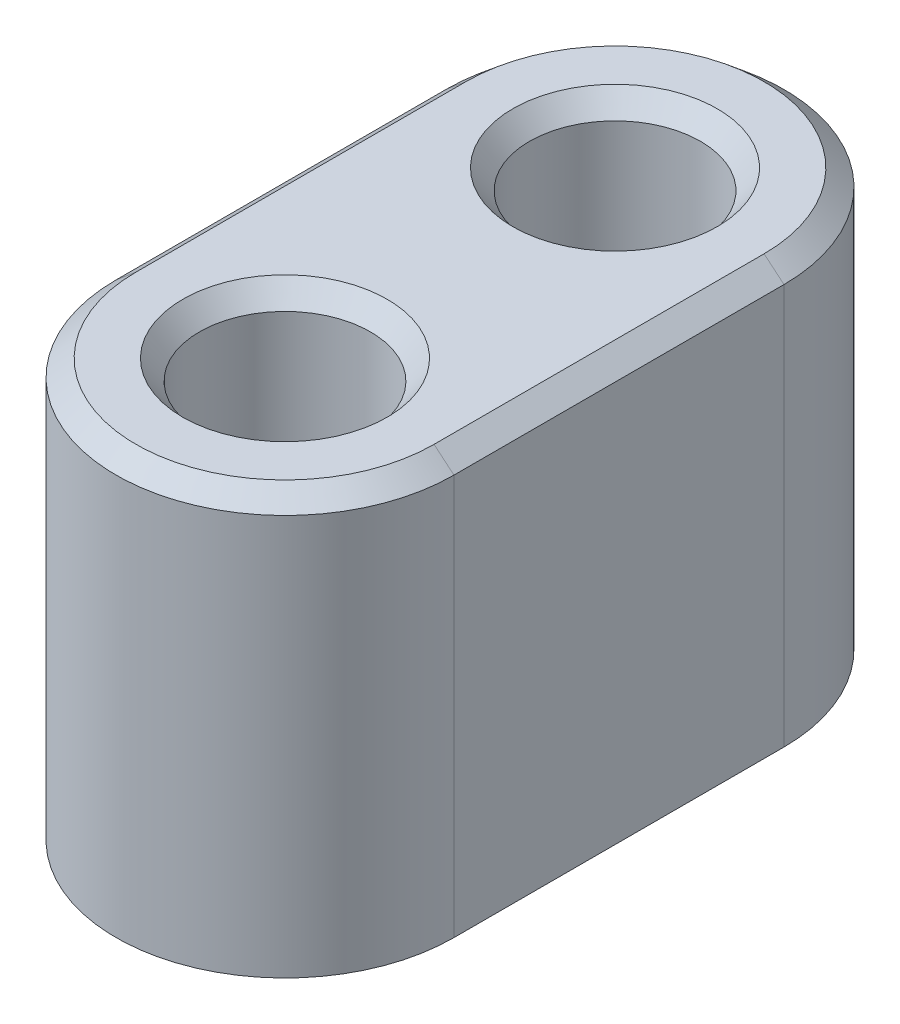
ISO-10303-21;
HEADER;
FILE_DESCRIPTION(('STEP AP214'),'2;1');
FILE_NAME('part.step','',(''),(''),'','','');
FILE_SCHEMA(('AUTOMOTIVE_DESIGN { 1 0 10303 214 1 1 1 1 }'));
ENDSEC;
DATA;
#1=APPLICATION_CONTEXT('core data for automotive mechanical design processes');
#2=APPLICATION_PROTOCOL_DEFINITION('international standard','automotive_design',2000,#1);
#3=PRODUCT_CONTEXT('',#1,'mechanical');
#4=PRODUCT('Part','Part','',(#3));
#5=PRODUCT_RELATED_PRODUCT_CATEGORY('part','',(#4));
#6=PRODUCT_DEFINITION_FORMATION('','',#4);
#7=PRODUCT_DEFINITION_CONTEXT('part definition',#1,'design');
#8=PRODUCT_DEFINITION('design','',#6,#7);
#9=PRODUCT_DEFINITION_SHAPE('','',#8);
#10=(LENGTH_UNIT() NAMED_UNIT(*) SI_UNIT(.MILLI.,.METRE.));
#11=(NAMED_UNIT(*) PLANE_ANGLE_UNIT() SI_UNIT($,.RADIAN.));
#12=(NAMED_UNIT(*) SI_UNIT($,.STERADIAN.) SOLID_ANGLE_UNIT());
#13=UNCERTAINTY_MEASURE_WITH_UNIT(LENGTH_MEASURE(1.E-05),#10,'distance_accuracy_value','');
#14=(GEOMETRIC_REPRESENTATION_CONTEXT(3) GLOBAL_UNCERTAINTY_ASSIGNED_CONTEXT((#13)) GLOBAL_UNIT_ASSIGNED_CONTEXT((#10,
#11,#12)) REPRESENTATION_CONTEXT('',''));
#15=CARTESIAN_POINT('',(0.,0.,0.));
#16=DIRECTION('',(0.,0.,1.));
#17=DIRECTION('',(1.,0.,0.));
#18=AXIS2_PLACEMENT_3D('',#15,#16,#17);
#19=CARTESIAN_POINT('',(0.,10.,3.955));
#20=DIRECTION('',(0.,1.,0.));
#21=DIRECTION('',(0.,0.,1.));
#22=AXIS2_PLACEMENT_3D('',#19,#20,#21);
#23=PLANE('',#22);
#24=CARTESIAN_POINT('',(0.,10.,3.955));
#25=DIRECTION('',(0.,1.,0.));
#26=DIRECTION('',(0.,0.,1.));
#27=AXIS2_PLACEMENT_3D('',#24,#25,#26);
#28=CIRCLE('',#27,3.57329856296232);
#29=CARTESIAN_POINT('',(-3.57329856296232,10.,3.955));
#30=VERTEX_POINT('',#29);
#31=CARTESIAN_POINT('',(3.57329856296232,10.,3.955));
#32=VERTEX_POINT('',#31);
#33=EDGE_CURVE('E179',#30,#32,#28,.T.);
#34=ORIENTED_EDGE('',*,*,#33,.T.);
#35=DIRECTION('',(0.,0.,-1.));
#36=VECTOR('',#35,1.);
#37=CARTESIAN_POINT('',(3.57329856296232,10.,-3.955));
#38=LINE('',#37,#36);
#39=CARTESIAN_POINT('',(3.57329856296232,10.,-3.955));
#40=VERTEX_POINT('',#39);
#41=EDGE_CURVE('E185',#32,#40,#38,.T.);
#42=ORIENTED_EDGE('',*,*,#41,.T.);
#43=CARTESIAN_POINT('',(0.,10.,-3.955));
#44=DIRECTION('',(0.,1.,0.));
#45=DIRECTION('',(0.,0.,1.));
#46=AXIS2_PLACEMENT_3D('',#43,#44,#45);
#47=CIRCLE('',#46,3.57329856296232);
#48=CARTESIAN_POINT('',(-3.57329856296232,10.,-3.955));
#49=VERTEX_POINT('',#48);
#50=EDGE_CURVE('E182',#40,#49,#47,.T.);
#51=ORIENTED_EDGE('',*,*,#50,.T.);
#52=DIRECTION('',(0.,0.,1.));
#53=VECTOR('',#52,1.);
#54=CARTESIAN_POINT('',(-3.57329856296232,10.,3.955));
#55=LINE('',#54,#53);
#56=EDGE_CURVE('E176',#49,#30,#55,.T.);
#57=ORIENTED_EDGE('',*,*,#56,.T.);
#58=EDGE_LOOP('',(#34,#42,#51,#57));
#59=FACE_BOUND('',#58,.T.);
#60=CARTESIAN_POINT('',(0.,10.,3.955));
#61=DIRECTION('',(0.,1.,0.));
#62=DIRECTION('',(0.,0.,1.));
#63=AXIS2_PLACEMENT_3D('',#60,#61,#62);
#64=CIRCLE('',#63,2.45);
#65=CARTESIAN_POINT('',(0.,10.,6.405));
#66=VERTEX_POINT('',#65);
#67=EDGE_CURVE('E172',#66,#66,#64,.F.);
#68=ORIENTED_EDGE('',*,*,#67,.T.);
#69=EDGE_LOOP('',(#68));
#70=FACE_BOUND('',#69,.T.);
#71=CARTESIAN_POINT('',(0.,10.,-3.955));
#72=DIRECTION('',(0.,1.,0.));
#73=DIRECTION('',(0.,0.,1.));
#74=AXIS2_PLACEMENT_3D('',#71,#72,#73);
#75=CIRCLE('',#74,2.45);
#76=CARTESIAN_POINT('',(0.,10.,-1.505));
#77=VERTEX_POINT('',#76);
#78=EDGE_CURVE('E168',#77,#77,#75,.F.);
#79=ORIENTED_EDGE('',*,*,#78,.T.);
#80=EDGE_LOOP('',(#79));
#81=FACE_BOUND('',#80,.T.);
#82=ADVANCED_FACE('F47',(#59,#70,#81),#23,.T.);
#83=CARTESIAN_POINT('',(0.,0.,3.955));
#84=DIRECTION('',(0.,1.,0.));
#85=DIRECTION('',(0.,0.,1.));
#86=AXIS2_PLACEMENT_3D('',#83,#84,#85);
#87=PLANE('',#86);
#88=CARTESIAN_POINT('',(0.,0.,-3.955));
#89=DIRECTION('',(0.,1.,0.));
#90=DIRECTION('',(0.,0.,1.));
#91=AXIS2_PLACEMENT_3D('',#88,#89,#90);
#92=CIRCLE('',#91,2.52670143703768);
#93=CARTESIAN_POINT('',(0.,0.,-6.48170143703768));
#94=VERTEX_POINT('',#93);
#95=EDGE_CURVE('E148',#94,#94,#92,.T.);
#96=ORIENTED_EDGE('',*,*,#95,.T.);
#97=EDGE_LOOP('',(#96));
#98=FACE_BOUND('',#97,.T.);
#99=CARTESIAN_POINT('',(0.,0.,3.955));
#100=DIRECTION('',(0.,1.,0.));
#101=DIRECTION('',(0.,0.,1.));
#102=AXIS2_PLACEMENT_3D('',#99,#100,#101);
#103=CIRCLE('',#102,2.52670143703768);
#104=CARTESIAN_POINT('',(0.,0.,6.48170143703768));
#105=VERTEX_POINT('',#104);
#106=EDGE_CURVE('E112',#105,#105,#103,.T.);
#107=ORIENTED_EDGE('',*,*,#106,.T.);
#108=EDGE_LOOP('',(#107));
#109=FACE_BOUND('',#108,.T.);
#110=CARTESIAN_POINT('',(0.,0.,3.955));
#111=DIRECTION('',(0.,1.,0.));
#112=DIRECTION('',(0.,0.,1.));
#113=AXIS2_PLACEMENT_3D('',#110,#111,#112);
#114=CIRCLE('',#113,4.05);
#115=CARTESIAN_POINT('',(-4.05,0.,3.955));
#116=VERTEX_POINT('',#115);
#117=CARTESIAN_POINT('',(4.05,0.,3.955));
#118=VERTEX_POINT('',#117);
#119=EDGE_CURVE('E119',#116,#118,#114,.T.);
#120=ORIENTED_EDGE('',*,*,#119,.F.);
#121=DIRECTION('',(0.,0.,1.));
#122=VECTOR('',#121,1.);
#123=CARTESIAN_POINT('',(-4.05,0.,3.955));
#124=LINE('',#123,#122);
#125=CARTESIAN_POINT('',(-4.05,0.,-3.955));
#126=VERTEX_POINT('',#125);
#127=EDGE_CURVE('E135',#126,#116,#124,.T.);
#128=ORIENTED_EDGE('',*,*,#127,.F.);
#129=CARTESIAN_POINT('',(0.,0.,-3.955));
#130=DIRECTION('',(0.,1.,0.));
#131=DIRECTION('',(0.,0.,1.));
#132=AXIS2_PLACEMENT_3D('',#129,#130,#131);
#133=CIRCLE('',#132,4.05);
#134=CARTESIAN_POINT('',(4.05,0.,-3.955));
#135=VERTEX_POINT('',#134);
#136=EDGE_CURVE('E121',#135,#126,#133,.T.);
#137=ORIENTED_EDGE('',*,*,#136,.F.);
#138=DIRECTION('',(0.,0.,-1.));
#139=VECTOR('',#138,1.);
#140=CARTESIAN_POINT('',(4.05,0.,3.955));
#141=LINE('',#140,#139);
#142=EDGE_CURVE('E106',#118,#135,#141,.T.);
#143=ORIENTED_EDGE('',*,*,#142,.F.);
#144=EDGE_LOOP('',(#120,#128,#137,#143));
#145=FACE_BOUND('',#144,.T.);
#146=ADVANCED_FACE('F117',(#98,#109,#145),#87,.F.);
#147=CARTESIAN_POINT('',(0.,10.,3.955));
#148=DIRECTION('',(0.,-1.,0.));
#149=DIRECTION('',(0.,0.,-1.));
#150=AXIS2_PLACEMENT_3D('',#147,#148,#149);
#151=CYLINDRICAL_SURFACE('',#150,4.05);
#152=DIRECTION('',(0.,-1.,0.));
#153=VECTOR('',#152,1.);
#154=CARTESIAN_POINT('',(4.05,10.,3.955));
#155=LINE('',#154,#153);
#156=CARTESIAN_POINT('',(4.05,9.6,3.955));
#157=VERTEX_POINT('',#156);
#158=EDGE_CURVE('E102',#157,#118,#155,.T.);
#159=ORIENTED_EDGE('',*,*,#158,.F.);
#160=CARTESIAN_POINT('',(0.,9.6,3.955));
#161=DIRECTION('',(0.,1.,0.));
#162=DIRECTION('',(0.,0.,1.));
#163=AXIS2_PLACEMENT_3D('',#160,#161,#162);
#164=CIRCLE('',#163,4.05);
#165=CARTESIAN_POINT('',(-4.05,9.6,3.955));
#166=VERTEX_POINT('',#165);
#167=EDGE_CURVE('E58',#157,#166,#164,.F.);
#168=ORIENTED_EDGE('',*,*,#167,.T.);
#169=DIRECTION('',(0.,-1.,0.));
#170=VECTOR('',#169,1.);
#171=CARTESIAN_POINT('',(-4.05,10.,3.955));
#172=LINE('',#171,#170);
#173=EDGE_CURVE('E125',#166,#116,#172,.T.);
#174=ORIENTED_EDGE('',*,*,#173,.T.);
#175=ORIENTED_EDGE('',*,*,#119,.T.);
#176=EDGE_LOOP('',(#159,#168,#174,#175));
#177=FACE_BOUND('',#176,.T.);
#178=ADVANCED_FACE('F124',(#177),#151,.T.);
#179=CARTESIAN_POINT('',(4.05,10.,3.955));
#180=DIRECTION('',(-1.,0.,0.));
#181=DIRECTION('',(0.,0.,1.));
#182=AXIS2_PLACEMENT_3D('',#179,#180,#181);
#183=PLANE('',#182);
#184=DIRECTION('',(0.,-1.,0.));
#185=VECTOR('',#184,1.);
#186=CARTESIAN_POINT('',(4.05,10.,-3.955));
#187=LINE('',#186,#185);
#188=CARTESIAN_POINT('',(4.05,9.6,-3.955));
#189=VERTEX_POINT('',#188);
#190=EDGE_CURVE('E113',#189,#135,#187,.T.);
#191=ORIENTED_EDGE('',*,*,#190,.F.);
#192=DIRECTION('',(0.,0.,1.));
#193=VECTOR('',#192,1.);
#194=CARTESIAN_POINT('',(4.05,9.6,3.955));
#195=LINE('',#194,#193);
#196=EDGE_CURVE('E109',#189,#157,#195,.T.);
#197=ORIENTED_EDGE('',*,*,#196,.T.);
#198=ORIENTED_EDGE('',*,*,#158,.T.);
#199=ORIENTED_EDGE('',*,*,#142,.T.);
#200=EDGE_LOOP('',(#191,#197,#198,#199));
#201=FACE_BOUND('',#200,.T.);
#202=ADVANCED_FACE('F105',(#201),#183,.F.);
#203=CARTESIAN_POINT('',(0.,10.,-3.955));
#204=DIRECTION('',(0.,-1.,0.));
#205=DIRECTION('',(0.,0.,-1.));
#206=AXIS2_PLACEMENT_3D('',#203,#204,#205);
#207=CYLINDRICAL_SURFACE('',#206,4.05);
#208=DIRECTION('',(0.,-1.,0.));
#209=VECTOR('',#208,1.);
#210=CARTESIAN_POINT('',(-4.05,10.,-3.955));
#211=LINE('',#210,#209);
#212=CARTESIAN_POINT('',(-4.05,9.6,-3.955));
#213=VERTEX_POINT('',#212);
#214=EDGE_CURVE('E140',#213,#126,#211,.T.);
#215=ORIENTED_EDGE('',*,*,#214,.F.);
#216=CARTESIAN_POINT('',(0.,9.6,-3.955));
#217=DIRECTION('',(0.,1.,0.));
#218=DIRECTION('',(0.,0.,1.));
#219=AXIS2_PLACEMENT_3D('',#216,#217,#218);
#220=CIRCLE('',#219,4.05);
#221=EDGE_CURVE('E191',#213,#189,#220,.F.);
#222=ORIENTED_EDGE('',*,*,#221,.T.);
#223=ORIENTED_EDGE('',*,*,#190,.T.);
#224=ORIENTED_EDGE('',*,*,#136,.T.);
#225=EDGE_LOOP('',(#215,#222,#223,#224));
#226=FACE_BOUND('',#225,.T.);
#227=ADVANCED_FACE('F246',(#226),#207,.T.);
#228=CARTESIAN_POINT('',(-4.05,10.,3.955));
#229=DIRECTION('',(1.,0.,0.));
#230=DIRECTION('',(0.,0.,-1.));
#231=AXIS2_PLACEMENT_3D('',#228,#229,#230);
#232=PLANE('',#231);
#233=ORIENTED_EDGE('',*,*,#173,.F.);
#234=DIRECTION('',(0.,0.,-1.));
#235=VECTOR('',#234,1.);
#236=CARTESIAN_POINT('',(-4.05,9.6,-3.955));
#237=LINE('',#236,#235);
#238=EDGE_CURVE('E11',#166,#213,#237,.T.);
#239=ORIENTED_EDGE('',*,*,#238,.T.);
#240=ORIENTED_EDGE('',*,*,#214,.T.);
#241=ORIENTED_EDGE('',*,*,#127,.T.);
#242=EDGE_LOOP('',(#233,#239,#240,#241));
#243=FACE_BOUND('',#242,.T.);
#244=ADVANCED_FACE('F243',(#243),#232,.F.);
#245=CARTESIAN_POINT('',(0.,10.,-3.955));
#246=DIRECTION('',(0.,-1.,0.));
#247=DIRECTION('',(0.,0.,-1.));
#248=AXIS2_PLACEMENT_3D('',#245,#246,#247);
#249=CYLINDRICAL_SURFACE('',#248,2.05);
#250=CARTESIAN_POINT('',(0.,0.399999999999999,-3.955));
#251=DIRECTION('',(0.,1.,0.));
#252=DIRECTION('',(0.,0.,1.));
#253=AXIS2_PLACEMENT_3D('',#250,#251,#252);
#254=CIRCLE('',#253,2.05);
#255=CARTESIAN_POINT('',(0.,0.399999999999999,-6.005));
#256=VERTEX_POINT('',#255);
#257=EDGE_CURVE('E156',#256,#256,#254,.F.);
#258=CARTESIAN_POINT('',(0.,9.52329856296232,-3.955));
#259=DIRECTION('',(0.,1.,0.));
#260=DIRECTION('',(0.,0.,1.));
#261=AXIS2_PLACEMENT_3D('',#258,#259,#260);
#262=CIRCLE('',#261,2.05);
#263=CARTESIAN_POINT('',(0.,9.52329856296232,-6.005));
#264=VERTEX_POINT('',#263);
#265=EDGE_CURVE('E152',#264,#264,#262,.T.);
#266=CARTESIAN_POINT('',(0.,0.399999999999999,-6.005));
#267=CARTESIAN_POINT('',(0.,0.495034360030857,-6.005));
#268=CARTESIAN_POINT('',(0.,0.590068720061714,-6.005));
#269=CARTESIAN_POINT('',(0.,0.780137440123429,-6.005));
#270=CARTESIAN_POINT('',(0.,0.875171800154286,-6.005));
#271=CARTESIAN_POINT('',(0.,1.065240520216,-6.005));
#272=CARTESIAN_POINT('',(0.,1.16027488024686,-6.005));
#273=CARTESIAN_POINT('',(0.,1.35034360030857,-6.005));
#274=CARTESIAN_POINT('',(0.,1.44537796033943,-6.005));
#275=CARTESIAN_POINT('',(0.,1.63544668040115,-6.005));
#276=CARTESIAN_POINT('',(0.,1.730481040432,-6.005));
#277=CARTESIAN_POINT('',(0.,1.92054976049372,-6.005));
#278=CARTESIAN_POINT('',(0.,2.01558412052458,-6.005));
#279=CARTESIAN_POINT('',(0.,2.20565284058629,-6.005));
#280=CARTESIAN_POINT('',(0.,2.30068720061715,-6.005));
#281=CARTESIAN_POINT('',(0.,2.49075592067886,-6.005));
#282=CARTESIAN_POINT('',(0.,2.58579028070972,-6.005));
#283=CARTESIAN_POINT('',(0.,2.77585900077144,-6.005));
#284=CARTESIAN_POINT('',(0.,2.87089336080229,-6.005));
#285=CARTESIAN_POINT('',(0.,3.06096208086401,-6.005));
#286=CARTESIAN_POINT('',(0.,3.15599644089487,-6.005));
#287=CARTESIAN_POINT('',(0.,3.34606516095658,-6.005));
#288=CARTESIAN_POINT('',(0.,3.44109952098744,-6.005));
#289=CARTESIAN_POINT('',(0.,3.63116824104915,-6.005));
#290=CARTESIAN_POINT('',(0.,3.72620260108001,-6.005));
#291=CARTESIAN_POINT('',(0.,3.91627132114172,-6.005));
#292=CARTESIAN_POINT('',(0.,4.01130568117258,-6.005));
#293=CARTESIAN_POINT('',(0.,4.2013744012343,-6.005));
#294=CARTESIAN_POINT('',(0.,4.29640876126515,-6.005));
#295=CARTESIAN_POINT('',(0.,4.48647748132687,-6.005));
#296=CARTESIAN_POINT('',(0.,4.58151184135773,-6.005));
#297=CARTESIAN_POINT('',(0.,4.77158056141944,-6.005));
#298=CARTESIAN_POINT('',(0.,4.8666149214503,-6.005));
#299=CARTESIAN_POINT('',(0.,5.05668364151201,-6.005));
#300=CARTESIAN_POINT('',(0.,5.15171800154287,-6.005));
#301=CARTESIAN_POINT('',(0.,5.34178672160459,-6.005));
#302=CARTESIAN_POINT('',(0.,5.43682108163544,-6.005));
#303=CARTESIAN_POINT('',(0.,5.62688980169716,-6.005));
#304=CARTESIAN_POINT('',(0.,5.72192416172802,-6.005));
#305=CARTESIAN_POINT('',(0.,5.91199288178973,-6.005));
#306=CARTESIAN_POINT('',(0.,6.00702724182059,-6.005));
#307=CARTESIAN_POINT('',(0.,6.1970959618823,-6.005));
#308=CARTESIAN_POINT('',(0.,6.29213032191316,-6.005));
#309=CARTESIAN_POINT('',(0.,6.48219904197487,-6.005));
#310=CARTESIAN_POINT('',(0.,6.57723340200573,-6.005));
#311=CARTESIAN_POINT('',(0.,6.76730212206745,-6.005));
#312=CARTESIAN_POINT('',(0.,6.86233648209831,-6.005));
#313=CARTESIAN_POINT('',(0.,7.05240520216002,-6.005));
#314=CARTESIAN_POINT('',(0.,7.14743956219088,-6.005));
#315=CARTESIAN_POINT('',(0.,7.33750828225259,-6.005));
#316=CARTESIAN_POINT('',(0.,7.43254264228345,-6.005));
#317=CARTESIAN_POINT('',(0.,7.62261136234516,-6.005));
#318=CARTESIAN_POINT('',(0.,7.71764572237602,-6.005));
#319=CARTESIAN_POINT('',(0.,7.90771444243774,-6.005));
#320=CARTESIAN_POINT('',(0.,8.00274880246859,-6.005));
#321=CARTESIAN_POINT('',(0.,8.19281752253031,-6.005));
#322=CARTESIAN_POINT('',(0.,8.28785188256117,-6.005));
#323=CARTESIAN_POINT('',(0.,8.47792060262288,-6.005));
#324=CARTESIAN_POINT('',(0.,8.57295496265374,-6.005));
#325=CARTESIAN_POINT('',(0.,8.76302368271545,-6.005));
#326=CARTESIAN_POINT('',(0.,8.85805804274631,-6.005));
#327=CARTESIAN_POINT('',(0.,9.04812676280803,-6.005));
#328=CARTESIAN_POINT('',(0.,9.14316112283888,-6.005));
#329=CARTESIAN_POINT('',(0.,9.3332298429006,-6.005));
#330=CARTESIAN_POINT('',(0.,9.42826420293146,-6.005));
#331=CARTESIAN_POINT('',(0.,9.52329856296231,-6.005));
#332=B_SPLINE_CURVE_WITH_KNOTS('',3,(#266,#267,#268,#269,#270,#271,#272,#273,#274,#275,#276,
#277,#278,#279,#280,#281,#282,#283,#284,#285,#286,#287,#288,#289,#290,#291,#292,#293,#294,#295,
#296,#297,#298,#299,#300,#301,#302,#303,#304,#305,#306,#307,#308,#309,#310,#311,#312,#313,#314,
#315,#316,#317,#318,#319,#320,#321,#322,#323,#324,#325,#326,#327,#328,#329,#330,#331),
.UNSPECIFIED.,.F.,.F.,(4,2,2,2,2,2,2,2,2,2,2,2,2,2,2,2,2,2,2,2,2,2,2,2,2,2,2,2,2,2,2,2,4),(0.,
0.285103080092572,0.570206160185145,0.855309240277716,1.14041232037029,1.42551540046286,
1.71061848055543,1.99572156064801,2.28082464074058,2.56592772083315,2.85103080092572,
3.1361338810183,3.42123696111087,3.70634004120344,3.99144312129601,4.27654620138858,
4.56164928148116,4.84675236157373,5.1318554416663,5.41695852175887,5.70206160185145,
5.98716468194402,6.27226776203659,6.55737084212916,6.84247392222174,7.12757700231431,
7.41268008240688,7.69778316249945,7.98288624259202,8.2679893226846,8.55309240277717,
8.83819548286974,9.12329856296231),.UNSPECIFIED.);
#333=EDGE_CURVE('BSEAM240',#256,#264,#332,.T.);
#334=ORIENTED_EDGE('',*,*,#257,.T.);
#335=ORIENTED_EDGE('',*,*,#265,.T.);
#336=ORIENTED_EDGE('',*,*,#333,.T.);
#337=ORIENTED_EDGE('',*,*,#333,.F.);
#338=EDGE_LOOP('',(#334,#336,#335,#337));
#339=FACE_BOUND('',#338,.T.);
#340=ADVANCED_FACE('F240',(#339),#249,.F.);
#341=CARTESIAN_POINT('',(0.,10.,3.955));
#342=DIRECTION('',(0.,-1.,0.));
#343=DIRECTION('',(0.,0.,-1.));
#344=AXIS2_PLACEMENT_3D('',#341,#342,#343);
#345=CYLINDRICAL_SURFACE('',#344,2.05);
#346=CARTESIAN_POINT('',(0.,0.399999999999998,3.955));
#347=DIRECTION('',(0.,1.,0.));
#348=DIRECTION('',(0.,0.,1.));
#349=AXIS2_PLACEMENT_3D('',#346,#347,#348);
#350=CIRCLE('',#349,2.05);
#351=CARTESIAN_POINT('',(0.,0.399999999999998,6.005));
#352=VERTEX_POINT('',#351);
#353=EDGE_CURVE('E164',#352,#352,#350,.F.);
#354=ORIENTED_EDGE('',*,*,#353,.T.);
#355=EDGE_LOOP('',(#354));
#356=FACE_BOUND('',#355,.T.);
#357=CARTESIAN_POINT('',(0.,9.52329856296232,3.955));
#358=DIRECTION('',(0.,1.,0.));
#359=DIRECTION('',(0.,0.,1.));
#360=AXIS2_PLACEMENT_3D('',#357,#358,#359);
#361=CIRCLE('',#360,2.05);
#362=CARTESIAN_POINT('',(0.,9.52329856296232,6.005));
#363=VERTEX_POINT('',#362);
#364=EDGE_CURVE('E160',#363,#363,#361,.T.);
#365=ORIENTED_EDGE('',*,*,#364,.T.);
#366=EDGE_LOOP('',(#365));
#367=FACE_BOUND('',#366,.T.);
#368=ADVANCED_FACE('F261',(#356,#367),#345,.F.);
#369=CARTESIAN_POINT('',(0.,0.,-3.955));
#370=DIRECTION('',(0.,-1.,0.));
#371=DIRECTION('',(0.,0.,-1.));
#372=AXIS2_PLACEMENT_3D('',#369,#370,#371);
#373=CONICAL_SURFACE('',#372,2.52670143703768,0.872664625997161);
#374=CARTESIAN_POINT('',(0.,0.399999999999999,-6.005));
#375=CARTESIAN_POINT('',(0.,0.395833333333333,-6.00996563996914));
#376=CARTESIAN_POINT('',(0.,0.391666666666666,-6.01493127993828));
#377=CARTESIAN_POINT('',(0.,0.383333333333333,-6.02486255987657));
#378=CARTESIAN_POINT('',(0.,0.379166666666666,-6.02982819984571));
#379=CARTESIAN_POINT('',(0.,0.370833333333333,-6.039759479784));
#380=CARTESIAN_POINT('',(0.,0.366666666666666,-6.04472511975314));
#381=CARTESIAN_POINT('',(0.,0.358333333333333,-6.05465639969143));
#382=CARTESIAN_POINT('',(0.,0.354166666666666,-6.05962203966057));
#383=CARTESIAN_POINT('',(0.,0.345833333333333,-6.06955331959885));
#384=CARTESIAN_POINT('',(0.,0.341666666666666,-6.07451895956799));
#385=CARTESIAN_POINT('',(0.,0.333333333333333,-6.08445023950628));
#386=CARTESIAN_POINT('',(0.,0.329166666666666,-6.08941587947542));
#387=CARTESIAN_POINT('',(0.,0.320833333333333,-6.09934715941371));
#388=CARTESIAN_POINT('',(0.,0.316666666666666,-6.10431279938285));
#389=CARTESIAN_POINT('',(0.,0.308333333333333,-6.11424407932113));
#390=CARTESIAN_POINT('',(0.,0.304166666666666,-6.11920971929028));
#391=CARTESIAN_POINT('',(0.,0.295833333333333,-6.12914099922856));
#392=CARTESIAN_POINT('',(0.,0.291666666666666,-6.1341066391977));
#393=CARTESIAN_POINT('',(0.,0.283333333333333,-6.14403791913599));
#394=CARTESIAN_POINT('',(0.,0.279166666666666,-6.14900355910513));
#395=CARTESIAN_POINT('',(0.,0.270833333333333,-6.15893483904342));
#396=CARTESIAN_POINT('',(0.,0.266666666666666,-6.16390047901256));
#397=CARTESIAN_POINT('',(0.,0.258333333333333,-6.17383175895085));
#398=CARTESIAN_POINT('',(0.,0.254166666666666,-6.17879739891999));
#399=CARTESIAN_POINT('',(0.,0.245833333333333,-6.18872867885827));
#400=CARTESIAN_POINT('',(0.,0.241666666666666,-6.19369431882741));
#401=CARTESIAN_POINT('',(0.,0.233333333333333,-6.2036255987657));
#402=CARTESIAN_POINT('',(0.,0.229166666666666,-6.20859123873484));
#403=CARTESIAN_POINT('',(0.,0.220833333333333,-6.21852251867313));
#404=CARTESIAN_POINT('',(0.,0.216666666666666,-6.22348815864227));
#405=CARTESIAN_POINT('',(0.,0.208333333333333,-6.23341943858056));
#406=CARTESIAN_POINT('',(0.,0.204166666666666,-6.2383850785497));
#407=CARTESIAN_POINT('',(0.,0.195833333333333,-6.24831635848798));
#408=CARTESIAN_POINT('',(0.,0.191666666666666,-6.25328199845712));
#409=CARTESIAN_POINT('',(0.,0.183333333333333,-6.26321327839541));
#410=CARTESIAN_POINT('',(0.,0.179166666666666,-6.26817891836455));
#411=CARTESIAN_POINT('',(0.,0.170833333333333,-6.27811019830284));
#412=CARTESIAN_POINT('',(0.,0.166666666666666,-6.28307583827198));
#413=CARTESIAN_POINT('',(0.,0.158333333333333,-6.29300711821026));
#414=CARTESIAN_POINT('',(0.,0.154166666666666,-6.29797275817941));
#415=CARTESIAN_POINT('',(0.,0.145833333333333,-6.30790403811769));
#416=CARTESIAN_POINT('',(0.,0.141666666666666,-6.31286967808683));
#417=CARTESIAN_POINT('',(0.,0.133333333333333,-6.32280095802512));
#418=CARTESIAN_POINT('',(0.,0.129166666666666,-6.32776659799426));
#419=CARTESIAN_POINT('',(0.,0.120833333333333,-6.33769787793255));
#420=CARTESIAN_POINT('',(0.,0.116666666666666,-6.34266351790169));
#421=CARTESIAN_POINT('',(0.,0.108333333333333,-6.35259479783998));
#422=CARTESIAN_POINT('',(0.,0.104166666666666,-6.35756043780912));
#423=CARTESIAN_POINT('',(0.,0.0958333333333332,-6.3674917177474));
#424=CARTESIAN_POINT('',(0.,0.0916666666666665,-6.37245735771654));
#425=CARTESIAN_POINT('',(0.,0.0833333333333332,-6.38238863765483));
#426=CARTESIAN_POINT('',(0.,0.0791666666666665,-6.38735427762397));
#427=CARTESIAN_POINT('',(0.,0.0708333333333332,-6.39728555756226));
#428=CARTESIAN_POINT('',(0.,0.0666666666666665,-6.4022511975314));
#429=CARTESIAN_POINT('',(0.,0.0583333333333332,-6.41218247746968));
#430=CARTESIAN_POINT('',(0.,0.0541666666666666,-6.41714811743883));
#431=CARTESIAN_POINT('',(0.,0.0458333333333333,-6.42707939737711));
#432=CARTESIAN_POINT('',(0.,0.0416666666666666,-6.43204503734625));
#433=CARTESIAN_POINT('',(0.,0.0333333333333333,-6.44197631728454));
#434=CARTESIAN_POINT('',(0.,0.0291666666666666,-6.44694195725368));
#435=CARTESIAN_POINT('',(0.,0.0208333333333333,-6.45687323719197));
#436=CARTESIAN_POINT('',(0.,0.0166666666666666,-6.46183887716111));
#437=CARTESIAN_POINT('',(0.,0.00833333333333332,-6.4717701570994));
#438=CARTESIAN_POINT('',(0.,0.00416666666666666,-6.47673579706854));
#439=CARTESIAN_POINT('',(0.,0.,-6.48170143703768));
#440=B_SPLINE_CURVE_WITH_KNOTS('',3,(#374,#375,#376,#377,#378,#379,#380,#381,#382,#383,#384,
#385,#386,#387,#388,#389,#390,#391,#392,#393,#394,#395,#396,#397,#398,#399,#400,#401,#402,#403,
#404,#405,#406,#407,#408,#409,#410,#411,#412,#413,#414,#415,#416,#417,#418,#419,#420,#421,#422,
#423,#424,#425,#426,#427,#428,#429,#430,#431,#432,#433,#434,#435,#436,#437,#438,#439),
.UNSPECIFIED.,.F.,.F.,(4,2,2,2,2,2,2,2,2,2,2,2,2,2,2,2,2,2,2,2,2,2,2,2,2,2,2,2,2,2,2,2,4),(0.,
0.019446547835755,0.0388930956715101,0.0583396435072651,0.0777861913430202,0.0972327391787752,
0.11667928701453,0.136125834850285,0.15557238268604,0.175018930521795,0.19446547835755,
0.213912026193305,0.23335857402906,0.252805121864815,0.272251669700571,0.291698217536326,
0.311144765372081,0.330591313207836,0.350037861043591,0.369484408879346,0.388930956715101,
0.408377504550856,0.427824052386611,0.447270600222366,0.466717148058121,0.486163695893876,
0.505610243729631,0.525056791565386,0.544503339401141,0.563949887236896,0.583396435072651,
0.602842982908407,0.622289530744162),.UNSPECIFIED.);
#441=EDGE_CURVE('BSEAM255',#256,#94,#440,.T.);
#442=ORIENTED_EDGE('',*,*,#257,.F.);
#443=ORIENTED_EDGE('',*,*,#95,.F.);
#444=ORIENTED_EDGE('',*,*,#441,.T.);
#445=ORIENTED_EDGE('',*,*,#441,.F.);
#446=EDGE_LOOP('',(#442,#444,#443,#445));
#447=FACE_BOUND('',#446,.T.);
#448=ADVANCED_FACE('F255',(#447),#373,.F.);
#449=CARTESIAN_POINT('',(0.,0.,3.955));
#450=DIRECTION('',(0.,-1.,0.));
#451=DIRECTION('',(0.,0.,-1.));
#452=AXIS2_PLACEMENT_3D('',#449,#450,#451);
#453=CONICAL_SURFACE('',#452,2.52670143703768,0.872664625997164);
#454=ORIENTED_EDGE('',*,*,#353,.F.);
#455=EDGE_LOOP('',(#454));
#456=FACE_BOUND('',#455,.T.);
#457=ORIENTED_EDGE('',*,*,#106,.F.);
#458=EDGE_LOOP('',(#457));
#459=FACE_BOUND('',#458,.T.);
#460=ADVANCED_FACE('F229',(#456,#459),#453,.F.);
#461=CARTESIAN_POINT('',(-3.57329856296232,10.,3.955));
#462=DIRECTION('',(-0.642787609686542,0.766044443118975,0.));
#463=DIRECTION('',(0.,0.,-1.));
#464=AXIS2_PLACEMENT_3D('',#461,#462,#463);
#465=PLANE('',#464);
#466=DIRECTION('',(0.766044443118975,0.642787609686542,0.));
#467=VECTOR('',#466,1.);
#468=CARTESIAN_POINT('',(-4.05,9.6,-3.955));
#469=LINE('',#468,#467);
#470=EDGE_CURVE('E131',#213,#49,#469,.T.);
#471=ORIENTED_EDGE('',*,*,#470,.F.);
#472=ORIENTED_EDGE('',*,*,#238,.F.);
#473=DIRECTION('',(-0.766044443118975,-0.642787609686542,0.));
#474=VECTOR('',#473,1.);
#475=CARTESIAN_POINT('',(-3.57329856296232,10.,3.955));
#476=LINE('',#475,#474);
#477=EDGE_CURVE('E52',#30,#166,#476,.T.);
#478=ORIENTED_EDGE('',*,*,#477,.F.);
#479=ORIENTED_EDGE('',*,*,#56,.F.);
#480=EDGE_LOOP('',(#471,#472,#478,#479));
#481=FACE_BOUND('',#480,.T.);
#482=ADVANCED_FACE('F211',(#481),#465,.T.);
#483=CARTESIAN_POINT('',(0.,10.,3.955));
#484=DIRECTION('',(0.,-1.,0.));
#485=DIRECTION('',(0.,0.,-1.));
#486=AXIS2_PLACEMENT_3D('',#483,#484,#485);
#487=CONICAL_SURFACE('',#486,3.57329856296232,0.872664625997161);
#488=ORIENTED_EDGE('',*,*,#477,.T.);
#489=ORIENTED_EDGE('',*,*,#167,.F.);
#490=DIRECTION('',(0.766044443118975,-0.642787609686542,0.));
#491=VECTOR('',#490,1.);
#492=CARTESIAN_POINT('',(3.57329856296232,10.,3.955));
#493=LINE('',#492,#491);
#494=EDGE_CURVE('E199',#32,#157,#493,.T.);
#495=ORIENTED_EDGE('',*,*,#494,.F.);
#496=ORIENTED_EDGE('',*,*,#33,.F.);
#497=EDGE_LOOP('',(#488,#489,#495,#496));
#498=FACE_BOUND('',#497,.T.);
#499=ADVANCED_FACE('F221',(#498),#487,.T.);
#500=CARTESIAN_POINT('',(0.,10.,-3.955));
#501=DIRECTION('',(0.,-1.,0.));
#502=DIRECTION('',(0.,0.,-1.));
#503=AXIS2_PLACEMENT_3D('',#500,#501,#502);
#504=CONICAL_SURFACE('',#503,3.57329856296232,0.872664625997161);
#505=ORIENTED_EDGE('',*,*,#470,.T.);
#506=ORIENTED_EDGE('',*,*,#50,.F.);
#507=DIRECTION('',(-0.766044443118975,0.642787609686542,0.));
#508=VECTOR('',#507,1.);
#509=CARTESIAN_POINT('',(4.05,9.6,-3.955));
#510=LINE('',#509,#508);
#511=EDGE_CURVE('E196',#189,#40,#510,.T.);
#512=ORIENTED_EDGE('',*,*,#511,.F.);
#513=ORIENTED_EDGE('',*,*,#221,.F.);
#514=EDGE_LOOP('',(#505,#506,#512,#513));
#515=FACE_BOUND('',#514,.T.);
#516=ADVANCED_FACE('F207',(#515),#504,.T.);
#517=CARTESIAN_POINT('',(3.57329856296232,10.,3.955));
#518=DIRECTION('',(0.642787609686542,0.766044443118975,0.));
#519=DIRECTION('',(0.,0.,1.));
#520=AXIS2_PLACEMENT_3D('',#517,#518,#519);
#521=PLANE('',#520);
#522=ORIENTED_EDGE('',*,*,#494,.T.);
#523=ORIENTED_EDGE('',*,*,#196,.F.);
#524=ORIENTED_EDGE('',*,*,#511,.T.);
#525=ORIENTED_EDGE('',*,*,#41,.F.);
#526=EDGE_LOOP('',(#522,#523,#524,#525));
#527=FACE_BOUND('',#526,.T.);
#528=ADVANCED_FACE('F219',(#527),#521,.T.);
#529=CARTESIAN_POINT('',(0.,9.52329856296232,3.955));
#530=DIRECTION('',(0.,1.,0.));
#531=DIRECTION('',(0.,0.,1.));
#532=AXIS2_PLACEMENT_3D('',#529,#530,#531);
#533=CONICAL_SURFACE('',#532,2.05,0.698131700797736);
#534=CARTESIAN_POINT('',(0.,10.,6.405));
#535=CARTESIAN_POINT('',(0.,9.99503436003086,6.40083333333334));
#536=CARTESIAN_POINT('',(0.,9.99006872006171,6.39666666666667));
#537=CARTESIAN_POINT('',(0.,9.98013744012343,6.38833333333334));
#538=CARTESIAN_POINT('',(0.,9.97517180015429,6.38416666666667));
#539=CARTESIAN_POINT('',(0.,9.965240520216,6.37583333333334));
#540=CARTESIAN_POINT('',(0.,9.96027488024686,6.37166666666667));
#541=CARTESIAN_POINT('',(0.,9.95034360030857,6.36333333333334));
#542=CARTESIAN_POINT('',(0.,9.94537796033943,6.35916666666667));
#543=CARTESIAN_POINT('',(0.,9.93544668040115,6.35083333333334));
#544=CARTESIAN_POINT('',(0.,9.930481040432,6.34666666666667));
#545=CARTESIAN_POINT('',(0.,9.92054976049372,6.33833333333334));
#546=CARTESIAN_POINT('',(0.,9.91558412052458,6.33416666666667));
#547=CARTESIAN_POINT('',(0.,9.90565284058629,6.32583333333334));
#548=CARTESIAN_POINT('',(0.,9.90068720061715,6.32166666666667));
#549=CARTESIAN_POINT('',(0.,9.89075592067886,6.31333333333334));
#550=CARTESIAN_POINT('',(0.,9.88579028070972,6.30916666666667));
#551=CARTESIAN_POINT('',(0.,9.87585900077144,6.30083333333334));
#552=CARTESIAN_POINT('',(0.,9.87089336080229,6.29666666666667));
#553=CARTESIAN_POINT('',(0.,9.86096208086401,6.28833333333334));
#554=CARTESIAN_POINT('',(0.,9.85599644089487,6.28416666666667));
#555=CARTESIAN_POINT('',(0.,9.84606516095658,6.27583333333334));
#556=CARTESIAN_POINT('',(0.,9.84109952098744,6.27166666666667));
#557=CARTESIAN_POINT('',(0.,9.83116824104915,6.26333333333334));
#558=CARTESIAN_POINT('',(0.,9.82620260108001,6.25916666666667));
#559=CARTESIAN_POINT('',(0.,9.81627132114172,6.25083333333334));
#560=CARTESIAN_POINT('',(0.,9.81130568117258,6.24666666666667));
#561=CARTESIAN_POINT('',(0.,9.8013744012343,6.23833333333333));
#562=CARTESIAN_POINT('',(0.,9.79640876126516,6.23416666666667));
#563=CARTESIAN_POINT('',(0.,9.78647748132687,6.22583333333333));
#564=CARTESIAN_POINT('',(0.,9.78151184135773,6.22166666666667));
#565=CARTESIAN_POINT('',(0.,9.77158056141944,6.21333333333333));
#566=CARTESIAN_POINT('',(0.,9.7666149214503,6.20916666666667));
#567=CARTESIAN_POINT('',(0.,9.75668364151201,6.20083333333334));
#568=CARTESIAN_POINT('',(0.,9.75171800154287,6.19666666666667));
#569=CARTESIAN_POINT('',(0.,9.74178672160459,6.18833333333334));
#570=CARTESIAN_POINT('',(0.,9.73682108163544,6.18416666666667));
#571=CARTESIAN_POINT('',(0.,9.72688980169716,6.17583333333333));
#572=CARTESIAN_POINT('',(0.,9.72192416172802,6.17166666666667));
#573=CARTESIAN_POINT('',(0.,9.71199288178973,6.16333333333333));
#574=CARTESIAN_POINT('',(0.,9.70702724182059,6.15916666666667));
#575=CARTESIAN_POINT('',(0.,9.6970959618823,6.15083333333333));
#576=CARTESIAN_POINT('',(0.,9.69213032191316,6.14666666666667));
#577=CARTESIAN_POINT('',(0.,9.68219904197488,6.13833333333333));
#578=CARTESIAN_POINT('',(0.,9.67723340200573,6.13416666666667));
#579=CARTESIAN_POINT('',(0.,9.66730212206745,6.12583333333333));
#580=CARTESIAN_POINT('',(0.,9.66233648209831,6.12166666666667));
#581=CARTESIAN_POINT('',(0.,9.65240520216002,6.11333333333333));
#582=CARTESIAN_POINT('',(0.,9.64743956219088,6.10916666666667));
#583=CARTESIAN_POINT('',(0.,9.63750828225259,6.10083333333333));
#584=CARTESIAN_POINT('',(0.,9.63254264228345,6.09666666666667));
#585=CARTESIAN_POINT('',(0.,9.62261136234517,6.08833333333333));
#586=CARTESIAN_POINT('',(0.,9.61764572237602,6.08416666666667));
#587=CARTESIAN_POINT('',(0.,9.60771444243774,6.07583333333333));
#588=CARTESIAN_POINT('',(0.,9.60274880246859,6.07166666666667));
#589=CARTESIAN_POINT('',(0.,9.59281752253031,6.06333333333333));
#590=CARTESIAN_POINT('',(0.,9.58785188256117,6.05916666666667));
#591=CARTESIAN_POINT('',(0.,9.57792060262288,6.05083333333333));
#592=CARTESIAN_POINT('',(0.,9.57295496265374,6.04666666666667));
#593=CARTESIAN_POINT('',(0.,9.56302368271545,6.03833333333333));
#594=CARTESIAN_POINT('',(0.,9.55805804274631,6.03416666666666));
#595=CARTESIAN_POINT('',(0.,9.54812676280803,6.02583333333333));
#596=CARTESIAN_POINT('',(0.,9.54316112283889,6.02166666666667));
#597=CARTESIAN_POINT('',(0.,9.5332298429006,6.01333333333333));
#598=CARTESIAN_POINT('',(0.,9.52826420293146,6.00916666666667));
#599=CARTESIAN_POINT('',(0.,9.52329856296232,6.005));
#600=B_SPLINE_CURVE_WITH_KNOTS('',3,(#534,#535,#536,#537,#538,#539,#540,#541,#542,#543,#544,
#545,#546,#547,#548,#549,#550,#551,#552,#553,#554,#555,#556,#557,#558,#559,#560,#561,#562,#563,
#564,#565,#566,#567,#568,#569,#570,#571,#572,#573,#574,#575,#576,#577,#578,#579,#580,#581,#582,
#583,#584,#585,#586,#587,#588,#589,#590,#591,#592,#593,#594,#595,#596,#597,#598,#599),
.UNSPECIFIED.,.F.,.F.,(4,2,2,2,2,2,2,2,2,2,2,2,2,2,2,2,2,2,2,2,2,2,2,2,2,2,2,2,2,2,2,2,4),(0.,
0.0194465478357554,0.0388930956715113,0.058339643507266,0.0777861913430219,0.0972327391787765,
0.116679287014532,0.136125834850288,0.155572382686043,0.175018930521798,0.194465478357553,
0.213912026193308,0.233358574029064,0.252805121864819,0.272251669700575,0.291698217536329,
0.311144765372085,0.33059131320784,0.350037861043595,0.369484408879351,0.388930956715106,
0.408377504550862,0.427824052386617,0.447270600222372,0.466717148058127,0.486163695893882,
0.505610243729637,0.525056791565393,0.544503339401148,0.563949887236904,0.583396435072659,
0.602842982908414,0.622289530744169),.UNSPECIFIED.);
#601=EDGE_CURVE('BSEAM275',#66,#363,#600,.T.);
#602=ORIENTED_EDGE('',*,*,#67,.F.);
#603=ORIENTED_EDGE('',*,*,#364,.F.);
#604=ORIENTED_EDGE('',*,*,#601,.T.);
#605=ORIENTED_EDGE('',*,*,#601,.F.);
#606=EDGE_LOOP('',(#602,#604,#603,#605));
#607=FACE_BOUND('',#606,.T.);
#608=ADVANCED_FACE('F275',(#607),#533,.F.);
#609=CARTESIAN_POINT('',(0.,9.52329856296232,-3.955));
#610=DIRECTION('',(0.,1.,0.));
#611=DIRECTION('',(0.,0.,1.));
#612=AXIS2_PLACEMENT_3D('',#609,#610,#611);
#613=CONICAL_SURFACE('',#612,2.05,0.698131700797736);
#614=ORIENTED_EDGE('',*,*,#78,.F.);
#615=EDGE_LOOP('',(#614));
#616=FACE_BOUND('',#615,.T.);
#617=ORIENTED_EDGE('',*,*,#265,.F.);
#618=EDGE_LOOP('',(#617));
#619=FACE_BOUND('',#618,.T.);
#620=ADVANCED_FACE('F50',(#616,#619),#613,.F.);
#621=CLOSED_SHELL('',(#82,#146,#178,#202,#227,#244,#340,#368,#448,#460,#482,#499,#516,#528,#608,#620));
#622=MANIFOLD_SOLID_BREP('B2',#621);
#623=ADVANCED_BREP_SHAPE_REPRESENTATION('',(#18,#622),#14);
#624=SHAPE_DEFINITION_REPRESENTATION(#9,#623);
ENDSEC;
END-ISO-10303-21;
